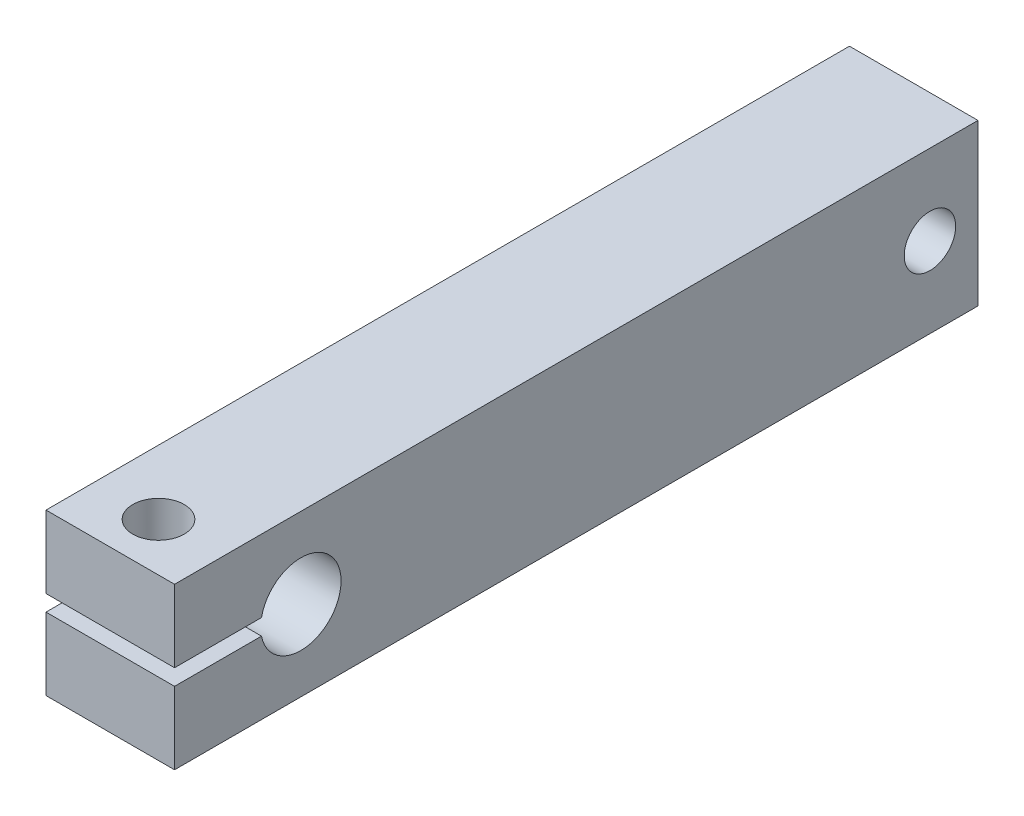
ISO-10303-21;
HEADER;
FILE_DESCRIPTION(('STEP AP214'),'2;1');
FILE_NAME('part.step','',(''),(''),'','','');
FILE_SCHEMA(('AUTOMOTIVE_DESIGN { 1 0 10303 214 1 1 1 1 }'));
ENDSEC;
DATA;
#1=APPLICATION_CONTEXT('core data for automotive mechanical design processes');
#2=APPLICATION_PROTOCOL_DEFINITION('international standard','automotive_design',2000,#1);
#3=PRODUCT_CONTEXT('',#1,'mechanical');
#4=PRODUCT('Part','Part','',(#3));
#5=PRODUCT_RELATED_PRODUCT_CATEGORY('part','',(#4));
#6=PRODUCT_DEFINITION_FORMATION('','',#4);
#7=PRODUCT_DEFINITION_CONTEXT('part definition',#1,'design');
#8=PRODUCT_DEFINITION('design','',#6,#7);
#9=PRODUCT_DEFINITION_SHAPE('','',#8);
#10=(LENGTH_UNIT() NAMED_UNIT(*) SI_UNIT(.MILLI.,.METRE.));
#11=(NAMED_UNIT(*) PLANE_ANGLE_UNIT() SI_UNIT($,.RADIAN.));
#12=(NAMED_UNIT(*) SI_UNIT($,.STERADIAN.) SOLID_ANGLE_UNIT());
#13=UNCERTAINTY_MEASURE_WITH_UNIT(LENGTH_MEASURE(1.E-05),#10,'distance_accuracy_value','');
#14=(GEOMETRIC_REPRESENTATION_CONTEXT(3) GLOBAL_UNCERTAINTY_ASSIGNED_CONTEXT((#13)) GLOBAL_UNIT_ASSIGNED_CONTEXT((#10,
#11,#12)) REPRESENTATION_CONTEXT('',''));
#15=CARTESIAN_POINT('',(0.,0.,0.));
#16=DIRECTION('',(0.,0.,1.));
#17=DIRECTION('',(1.,0.,0.));
#18=AXIS2_PLACEMENT_3D('',#15,#16,#17);
#19=CARTESIAN_POINT('',(0.,0.,40.));
#20=DIRECTION('',(0.,0.,-1.));
#21=DIRECTION('',(-1.,0.,0.));
#22=AXIS2_PLACEMENT_3D('',#19,#20,#21);
#23=PLANE('',#22);
#24=DIRECTION('',(0.,1.,0.));
#25=VECTOR('',#24,1.);
#26=CARTESIAN_POINT('',(8.,0.,40.));
#27=LINE('',#26,#25);
#28=CARTESIAN_POINT('',(8.,0.,40.));
#29=VERTEX_POINT('',#28);
#30=CARTESIAN_POINT('',(8.,4.5,40.));
#31=VERTEX_POINT('',#30);
#32=EDGE_CURVE('E161',#29,#31,#27,.T.);
#33=ORIENTED_EDGE('',*,*,#32,.T.);
#34=DIRECTION('',(-1.,0.,0.));
#35=VECTOR('',#34,1.);
#36=CARTESIAN_POINT('',(8.,4.5,40.));
#37=LINE('',#36,#35);
#38=CARTESIAN_POINT('',(0.,4.5,40.));
#39=VERTEX_POINT('',#38);
#40=EDGE_CURVE('E133',#31,#39,#37,.T.);
#41=ORIENTED_EDGE('',*,*,#40,.T.);
#42=DIRECTION('',(0.,-1.,0.));
#43=VECTOR('',#42,1.);
#44=CARTESIAN_POINT('',(0.,0.,40.));
#45=LINE('',#44,#43);
#46=CARTESIAN_POINT('',(0.,0.,40.));
#47=VERTEX_POINT('',#46);
#48=EDGE_CURVE('E156',#39,#47,#45,.T.);
#49=ORIENTED_EDGE('',*,*,#48,.T.);
#50=DIRECTION('',(1.,0.,0.));
#51=VECTOR('',#50,1.);
#52=CARTESIAN_POINT('',(0.,0.,40.));
#53=LINE('',#52,#51);
#54=EDGE_CURVE('E159',#47,#29,#53,.T.);
#55=ORIENTED_EDGE('',*,*,#54,.T.);
#56=EDGE_LOOP('',(#33,#41,#49,#55));
#57=FACE_BOUND('',#56,.T.);
#58=ADVANCED_FACE('F35',(#57),#23,.F.);
#59=CARTESIAN_POINT('',(0.,0.,40.));
#60=DIRECTION('',(1.,0.,0.));
#61=DIRECTION('',(0.,0.,-1.));
#62=AXIS2_PLACEMENT_3D('',#59,#60,#61);
#63=PLANE('',#62);
#64=CARTESIAN_POINT('',(0.,5.,-7.0094550998289));
#65=DIRECTION('',(1.,0.,0.));
#66=DIRECTION('',(0.,0.,-1.));
#67=AXIS2_PLACEMENT_3D('',#64,#65,#66);
#68=CIRCLE('',#67,1.6);
#69=CARTESIAN_POINT('',(0.,5.,-8.6094550998289));
#70=VERTEX_POINT('',#69);
#71=EDGE_CURVE('E139',#70,#70,#68,.T.);
#72=ORIENTED_EDGE('',*,*,#71,.T.);
#73=EDGE_LOOP('',(#72));
#74=FACE_BOUND('',#73,.T.);
#75=ORIENTED_EDGE('',*,*,#48,.F.);
#76=DIRECTION('',(0.,0.,1.));
#77=VECTOR('',#76,1.);
#78=CARTESIAN_POINT('',(0.,4.5,34.59));
#79=LINE('',#78,#77);
#80=CARTESIAN_POINT('',(0.,4.5,34.59));
#81=VERTEX_POINT('',#80);
#82=EDGE_CURVE('E122',#81,#39,#79,.T.);
#83=ORIENTED_EDGE('',*,*,#82,.F.);
#84=CARTESIAN_POINT('',(0.,5.,32.14));
#85=DIRECTION('',(-1.,0.,0.));
#86=DIRECTION('',(0.,0.,1.));
#87=AXIS2_PLACEMENT_3D('',#84,#85,#86);
#88=CIRCLE('',#87,2.50049995001);
#89=CARTESIAN_POINT('',(0.,5.5,34.59));
#90=VERTEX_POINT('',#89);
#91=EDGE_CURVE('E124',#90,#81,#88,.T.);
#92=ORIENTED_EDGE('',*,*,#91,.F.);
#93=DIRECTION('',(0.,0.,-1.));
#94=VECTOR('',#93,1.);
#95=CARTESIAN_POINT('',(0.,5.5,40.));
#96=LINE('',#95,#94);
#97=CARTESIAN_POINT('',(0.,5.5,40.));
#98=VERTEX_POINT('',#97);
#99=EDGE_CURVE('E103',#98,#90,#96,.T.);
#100=ORIENTED_EDGE('',*,*,#99,.F.);
#101=CARTESIAN_POINT('',(0.,10.,40.));
#102=VERTEX_POINT('',#101);
#103=EDGE_CURVE('E157',#102,#98,#45,.T.);
#104=ORIENTED_EDGE('',*,*,#103,.F.);
#105=DIRECTION('',(0.,0.,-1.));
#106=VECTOR('',#105,1.);
#107=CARTESIAN_POINT('',(0.,10.,40.));
#108=LINE('',#107,#106);
#109=CARTESIAN_POINT('',(0.,10.,-10.));
#110=VERTEX_POINT('',#109);
#111=EDGE_CURVE('E165',#102,#110,#108,.T.);
#112=ORIENTED_EDGE('',*,*,#111,.T.);
#113=DIRECTION('',(0.,1.,0.));
#114=VECTOR('',#113,1.);
#115=CARTESIAN_POINT('',(0.,10.,-10.));
#116=LINE('',#115,#114);
#117=CARTESIAN_POINT('',(0.,0.,-10.));
#118=VERTEX_POINT('',#117);
#119=EDGE_CURVE('E150',#118,#110,#116,.T.);
#120=ORIENTED_EDGE('',*,*,#119,.F.);
#121=DIRECTION('',(0.,0.,-1.));
#122=VECTOR('',#121,1.);
#123=CARTESIAN_POINT('',(0.,0.,40.));
#124=LINE('',#123,#122);
#125=EDGE_CURVE('E11',#47,#118,#124,.T.);
#126=ORIENTED_EDGE('',*,*,#125,.F.);
#127=EDGE_LOOP('',(#75,#83,#92,#100,#104,#112,#120,#126));
#128=FACE_BOUND('',#127,.T.);
#129=ADVANCED_FACE('F37',(#74,#128),#63,.F.);
#130=CARTESIAN_POINT('',(0.,0.,40.));
#131=DIRECTION('',(0.,1.,0.));
#132=DIRECTION('',(0.,0.,1.));
#133=AXIS2_PLACEMENT_3D('',#130,#131,#132);
#134=PLANE('',#133);
#135=CARTESIAN_POINT('',(4.,0.,37.));
#136=DIRECTION('',(0.,-1.,0.));
#137=DIRECTION('',(0.,0.,-1.));
#138=AXIS2_PLACEMENT_3D('',#135,#136,#137);
#139=CIRCLE('',#138,1.6);
#140=CARTESIAN_POINT('',(4.,0.,35.4));
#141=VERTEX_POINT('',#140);
#142=EDGE_CURVE('E232',#141,#141,#139,.T.);
#143=ORIENTED_EDGE('',*,*,#142,.F.);
#144=EDGE_LOOP('',(#143));
#145=FACE_BOUND('',#144,.T.);
#146=ORIENTED_EDGE('',*,*,#125,.T.);
#147=DIRECTION('',(-1.,0.,0.));
#148=VECTOR('',#147,1.);
#149=CARTESIAN_POINT('',(8.,0.,-10.));
#150=LINE('',#149,#148);
#151=CARTESIAN_POINT('',(8.,0.,-10.));
#152=VERTEX_POINT('',#151);
#153=EDGE_CURVE('E147',#152,#118,#150,.T.);
#154=ORIENTED_EDGE('',*,*,#153,.F.);
#155=DIRECTION('',(0.,0.,-1.));
#156=VECTOR('',#155,1.);
#157=CARTESIAN_POINT('',(8.,0.,40.));
#158=LINE('',#157,#156);
#159=EDGE_CURVE('E44',#29,#152,#158,.T.);
#160=ORIENTED_EDGE('',*,*,#159,.F.);
#161=ORIENTED_EDGE('',*,*,#54,.F.);
#162=EDGE_LOOP('',(#146,#154,#160,#161));
#163=FACE_BOUND('',#162,.T.);
#164=ADVANCED_FACE('F175',(#145,#163),#134,.F.);
#165=CARTESIAN_POINT('',(8.,0.,40.));
#166=DIRECTION('',(-1.,0.,0.));
#167=DIRECTION('',(0.,0.,1.));
#168=AXIS2_PLACEMENT_3D('',#165,#166,#167);
#169=PLANE('',#168);
#170=CARTESIAN_POINT('',(8.,5.,-7.0094550998289));
#171=DIRECTION('',(1.,0.,0.));
#172=DIRECTION('',(0.,0.,-1.));
#173=AXIS2_PLACEMENT_3D('',#170,#171,#172);
#174=CIRCLE('',#173,1.6);
#175=CARTESIAN_POINT('',(8.,5.,-8.6094550998289));
#176=VERTEX_POINT('',#175);
#177=EDGE_CURVE('E136',#176,#176,#174,.T.);
#178=ORIENTED_EDGE('',*,*,#177,.F.);
#179=EDGE_LOOP('',(#178));
#180=FACE_BOUND('',#179,.T.);
#181=CARTESIAN_POINT('',(8.,5.,32.14));
#182=DIRECTION('',(-1.,0.,0.));
#183=DIRECTION('',(0.,0.,1.));
#184=AXIS2_PLACEMENT_3D('',#181,#182,#183);
#185=CIRCLE('',#184,2.50049995001);
#186=CARTESIAN_POINT('',(8.,5.5,34.59));
#187=VERTEX_POINT('',#186);
#188=CARTESIAN_POINT('',(8.,4.5,34.59));
#189=VERTEX_POINT('',#188);
#190=EDGE_CURVE('E111',#187,#189,#185,.T.);
#191=ORIENTED_EDGE('',*,*,#190,.T.);
#192=DIRECTION('',(0.,0.,1.));
#193=VECTOR('',#192,1.);
#194=CARTESIAN_POINT('',(8.,4.5,34.59));
#195=LINE('',#194,#193);
#196=EDGE_CURVE('E116',#189,#31,#195,.T.);
#197=ORIENTED_EDGE('',*,*,#196,.T.);
#198=ORIENTED_EDGE('',*,*,#32,.F.);
#199=ORIENTED_EDGE('',*,*,#159,.T.);
#200=DIRECTION('',(0.,-1.,0.));
#201=VECTOR('',#200,1.);
#202=CARTESIAN_POINT('',(8.,10.,-10.));
#203=LINE('',#202,#201);
#204=CARTESIAN_POINT('',(8.,10.,-10.));
#205=VERTEX_POINT('',#204);
#206=EDGE_CURVE('E142',#205,#152,#203,.T.);
#207=ORIENTED_EDGE('',*,*,#206,.F.);
#208=DIRECTION('',(0.,0.,-1.));
#209=VECTOR('',#208,1.);
#210=CARTESIAN_POINT('',(8.,10.,40.));
#211=LINE('',#210,#209);
#212=CARTESIAN_POINT('',(8.,10.,40.));
#213=VERTEX_POINT('',#212);
#214=EDGE_CURVE('E167',#213,#205,#211,.T.);
#215=ORIENTED_EDGE('',*,*,#214,.F.);
#216=CARTESIAN_POINT('',(8.,5.5,40.));
#217=VERTEX_POINT('',#216);
#218=EDGE_CURVE('E121',#217,#213,#27,.T.);
#219=ORIENTED_EDGE('',*,*,#218,.F.);
#220=DIRECTION('',(0.,0.,-1.));
#221=VECTOR('',#220,1.);
#222=CARTESIAN_POINT('',(8.,5.5,40.));
#223=LINE('',#222,#221);
#224=EDGE_CURVE('E51',#217,#187,#223,.T.);
#225=ORIENTED_EDGE('',*,*,#224,.T.);
#226=EDGE_LOOP('',(#191,#197,#198,#199,#207,#215,#219,#225));
#227=FACE_BOUND('',#226,.T.);
#228=ADVANCED_FACE('F119',(#180,#227),#169,.F.);
#229=CARTESIAN_POINT('',(0.,10.,40.));
#230=DIRECTION('',(0.,-1.,0.));
#231=DIRECTION('',(0.,0.,-1.));
#232=AXIS2_PLACEMENT_3D('',#229,#230,#231);
#233=PLANE('',#232);
#234=CARTESIAN_POINT('',(4.,10.,37.));
#235=DIRECTION('',(0.,-1.,0.));
#236=DIRECTION('',(0.,0.,-1.));
#237=AXIS2_PLACEMENT_3D('',#234,#235,#236);
#238=CIRCLE('',#237,1.6);
#239=CARTESIAN_POINT('',(4.,10.,35.4));
#240=VERTEX_POINT('',#239);
#241=EDGE_CURVE('E230',#240,#240,#238,.T.);
#242=ORIENTED_EDGE('',*,*,#241,.T.);
#243=EDGE_LOOP('',(#242));
#244=FACE_BOUND('',#243,.T.);
#245=ORIENTED_EDGE('',*,*,#214,.T.);
#246=DIRECTION('',(1.,0.,0.));
#247=VECTOR('',#246,1.);
#248=CARTESIAN_POINT('',(8.,10.,-10.));
#249=LINE('',#248,#247);
#250=EDGE_CURVE('E153',#110,#205,#249,.T.);
#251=ORIENTED_EDGE('',*,*,#250,.F.);
#252=ORIENTED_EDGE('',*,*,#111,.F.);
#253=DIRECTION('',(-1.,0.,0.));
#254=VECTOR('',#253,1.);
#255=CARTESIAN_POINT('',(0.,10.,40.));
#256=LINE('',#255,#254);
#257=EDGE_CURVE('E59',#213,#102,#256,.T.);
#258=ORIENTED_EDGE('',*,*,#257,.F.);
#259=EDGE_LOOP('',(#245,#251,#252,#258));
#260=FACE_BOUND('',#259,.T.);
#261=ADVANCED_FACE('F182',(#244,#260),#233,.F.);
#262=ORIENTED_EDGE('',*,*,#103,.T.);
#263=DIRECTION('',(-1.,0.,0.));
#264=VECTOR('',#263,1.);
#265=CARTESIAN_POINT('',(8.,5.5,40.));
#266=LINE('',#265,#264);
#267=EDGE_CURVE('E108',#217,#98,#266,.T.);
#268=ORIENTED_EDGE('',*,*,#267,.F.);
#269=ORIENTED_EDGE('',*,*,#218,.T.);
#270=ORIENTED_EDGE('',*,*,#257,.T.);
#271=EDGE_LOOP('',(#262,#268,#269,#270));
#272=FACE_BOUND('',#271,.T.);
#273=ADVANCED_FACE('F186',(#272),#23,.F.);
#274=CARTESIAN_POINT('',(0.,0.,-10.));
#275=DIRECTION('',(0.,0.,-1.));
#276=DIRECTION('',(-1.,0.,0.));
#277=AXIS2_PLACEMENT_3D('',#274,#275,#276);
#278=PLANE('',#277);
#279=ORIENTED_EDGE('',*,*,#206,.T.);
#280=ORIENTED_EDGE('',*,*,#153,.T.);
#281=ORIENTED_EDGE('',*,*,#119,.T.);
#282=ORIENTED_EDGE('',*,*,#250,.T.);
#283=EDGE_LOOP('',(#279,#280,#281,#282));
#284=FACE_BOUND('',#283,.T.);
#285=ADVANCED_FACE('F179',(#284),#278,.T.);
#286=CARTESIAN_POINT('',(0.,5.,-7.0094550998289));
#287=DIRECTION('',(1.,0.,0.));
#288=DIRECTION('',(0.,0.,-1.));
#289=AXIS2_PLACEMENT_3D('',#286,#287,#288);
#290=CYLINDRICAL_SURFACE('',#289,1.6);
#291=ORIENTED_EDGE('',*,*,#71,.F.);
#292=EDGE_LOOP('',(#291));
#293=FACE_BOUND('',#292,.T.);
#294=ORIENTED_EDGE('',*,*,#177,.T.);
#295=EDGE_LOOP('',(#294));
#296=FACE_BOUND('',#295,.T.);
#297=ADVANCED_FACE('F193',(#293,#296),#290,.F.);
#298=CARTESIAN_POINT('',(8.,4.5,34.59));
#299=DIRECTION('',(0.,-1.,0.));
#300=DIRECTION('',(0.,0.,-1.));
#301=AXIS2_PLACEMENT_3D('',#298,#299,#300);
#302=PLANE('',#301);
#303=CARTESIAN_POINT('',(4.,4.5,37.));
#304=DIRECTION('',(0.,-1.,0.));
#305=DIRECTION('',(0.,0.,-1.));
#306=AXIS2_PLACEMENT_3D('',#303,#304,#305);
#307=CIRCLE('',#306,1.6);
#308=CARTESIAN_POINT('',(4.,4.5,35.4));
#309=VERTEX_POINT('',#308);
#310=EDGE_CURVE('E127',#309,#309,#307,.T.);
#311=ORIENTED_EDGE('',*,*,#310,.T.);
#312=EDGE_LOOP('',(#311));
#313=FACE_BOUND('',#312,.T.);
#314=ORIENTED_EDGE('',*,*,#82,.T.);
#315=ORIENTED_EDGE('',*,*,#40,.F.);
#316=ORIENTED_EDGE('',*,*,#196,.F.);
#317=DIRECTION('',(-1.,0.,0.));
#318=VECTOR('',#317,1.);
#319=CARTESIAN_POINT('',(8.,4.5,34.59));
#320=LINE('',#319,#318);
#321=EDGE_CURVE('E107',#189,#81,#320,.T.);
#322=ORIENTED_EDGE('',*,*,#321,.T.);
#323=EDGE_LOOP('',(#314,#315,#316,#322));
#324=FACE_BOUND('',#323,.T.);
#325=ADVANCED_FACE('F205',(#313,#324),#302,.F.);
#326=CARTESIAN_POINT('',(8.,5.,32.14));
#327=DIRECTION('',(-1.,0.,0.));
#328=DIRECTION('',(0.,0.,1.));
#329=AXIS2_PLACEMENT_3D('',#326,#327,#328);
#330=CYLINDRICAL_SURFACE('',#329,2.50049995001);
#331=ORIENTED_EDGE('',*,*,#91,.T.);
#332=ORIENTED_EDGE('',*,*,#321,.F.);
#333=ORIENTED_EDGE('',*,*,#190,.F.);
#334=DIRECTION('',(-1.,0.,0.));
#335=VECTOR('',#334,1.);
#336=CARTESIAN_POINT('',(8.,5.5,34.59));
#337=LINE('',#336,#335);
#338=EDGE_CURVE('E99',#187,#90,#337,.T.);
#339=ORIENTED_EDGE('',*,*,#338,.T.);
#340=EDGE_LOOP('',(#331,#332,#333,#339));
#341=FACE_BOUND('',#340,.T.);
#342=ADVANCED_FACE('F112',(#341),#330,.F.);
#343=CARTESIAN_POINT('',(8.,5.5,40.));
#344=DIRECTION('',(0.,1.,0.));
#345=DIRECTION('',(0.,0.,1.));
#346=AXIS2_PLACEMENT_3D('',#343,#344,#345);
#347=PLANE('',#346);
#348=CARTESIAN_POINT('',(4.,5.5,37.));
#349=DIRECTION('',(0.,1.,0.));
#350=DIRECTION('',(0.,0.,1.));
#351=AXIS2_PLACEMENT_3D('',#348,#349,#350);
#352=CIRCLE('',#351,1.6);
#353=CARTESIAN_POINT('',(4.,5.5,38.6));
#354=VERTEX_POINT('',#353);
#355=EDGE_CURVE('E39',#354,#354,#352,.T.);
#356=ORIENTED_EDGE('',*,*,#355,.T.);
#357=EDGE_LOOP('',(#356));
#358=FACE_BOUND('',#357,.T.);
#359=ORIENTED_EDGE('',*,*,#99,.T.);
#360=ORIENTED_EDGE('',*,*,#338,.F.);
#361=ORIENTED_EDGE('',*,*,#224,.F.);
#362=ORIENTED_EDGE('',*,*,#267,.T.);
#363=EDGE_LOOP('',(#359,#360,#361,#362));
#364=FACE_BOUND('',#363,.T.);
#365=ADVANCED_FACE('F101',(#358,#364),#347,.F.);
#366=CARTESIAN_POINT('',(4.,10.,37.));
#367=DIRECTION('',(0.,-1.,0.));
#368=DIRECTION('',(0.,0.,-1.));
#369=AXIS2_PLACEMENT_3D('',#366,#367,#368);
#370=CYLINDRICAL_SURFACE('',#369,1.6);
#371=ORIENTED_EDGE('',*,*,#241,.F.);
#372=EDGE_LOOP('',(#371));
#373=FACE_BOUND('',#372,.T.);
#374=ORIENTED_EDGE('',*,*,#355,.F.);
#375=EDGE_LOOP('',(#374));
#376=FACE_BOUND('',#375,.T.);
#377=ADVANCED_FACE('F221',(#373,#376),#370,.F.);
#378=ORIENTED_EDGE('',*,*,#142,.T.);
#379=EDGE_LOOP('',(#378));
#380=FACE_BOUND('',#379,.T.);
#381=ORIENTED_EDGE('',*,*,#310,.F.);
#382=EDGE_LOOP('',(#381));
#383=FACE_BOUND('',#382,.T.);
#384=ADVANCED_FACE('F218',(#380,#383),#370,.F.);
#385=CLOSED_SHELL('',(#58,#129,#164,#228,#261,#273,#285,#297,#325,#342,#365,#377,#384));
#386=MANIFOLD_SOLID_BREP('B2',#385);
#387=ADVANCED_BREP_SHAPE_REPRESENTATION('',(#18,#386),#14);
#388=SHAPE_DEFINITION_REPRESENTATION(#9,#387);
ENDSEC;
END-ISO-10303-21;
